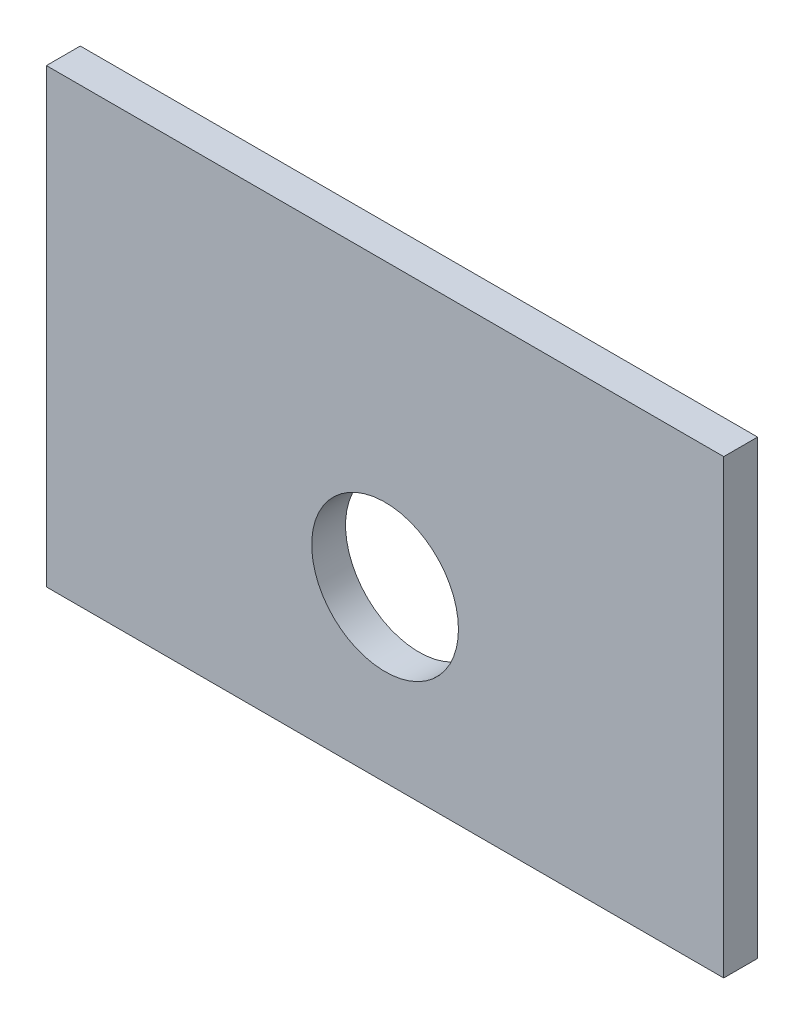
ISO-10303-21;
HEADER;
FILE_DESCRIPTION(('STEP AP214'),'2;1');
FILE_NAME('part.step','',(''),(''),'','','');
FILE_SCHEMA(('AUTOMOTIVE_DESIGN { 1 0 10303 214 1 1 1 1 }'));
ENDSEC;
DATA;
#1=APPLICATION_CONTEXT('core data for automotive mechanical design processes');
#2=APPLICATION_PROTOCOL_DEFINITION('international standard','automotive_design',2000,#1);
#3=PRODUCT_CONTEXT('',#1,'mechanical');
#4=PRODUCT('Part','Part','',(#3));
#5=PRODUCT_RELATED_PRODUCT_CATEGORY('part','',(#4));
#6=PRODUCT_DEFINITION_FORMATION('','',#4);
#7=PRODUCT_DEFINITION_CONTEXT('part definition',#1,'design');
#8=PRODUCT_DEFINITION('design','',#6,#7);
#9=PRODUCT_DEFINITION_SHAPE('','',#8);
#10=(LENGTH_UNIT() NAMED_UNIT(*) SI_UNIT(.MILLI.,.METRE.));
#11=(NAMED_UNIT(*) PLANE_ANGLE_UNIT() SI_UNIT($,.RADIAN.));
#12=(NAMED_UNIT(*) SI_UNIT($,.STERADIAN.) SOLID_ANGLE_UNIT());
#13=UNCERTAINTY_MEASURE_WITH_UNIT(LENGTH_MEASURE(1.E-05),#10,'distance_accuracy_value','');
#14=(GEOMETRIC_REPRESENTATION_CONTEXT(3) GLOBAL_UNCERTAINTY_ASSIGNED_CONTEXT((#13)) GLOBAL_UNIT_ASSIGNED_CONTEXT((#10,
#11,#12)) REPRESENTATION_CONTEXT('',''));
#15=CARTESIAN_POINT('',(0.,0.,0.));
#16=DIRECTION('',(0.,0.,1.));
#17=DIRECTION('',(1.,0.,0.));
#18=AXIS2_PLACEMENT_3D('',#15,#16,#17);
#19=CARTESIAN_POINT('',(0.,0.,-1.5));
#20=DIRECTION('',(-1.,0.,0.));
#21=DIRECTION('',(0.,-1.,0.));
#22=AXIS2_PLACEMENT_3D('',#19,#20,#21);
#23=PLANE('',#22);
#24=DIRECTION('',(0.,-1.,0.));
#25=VECTOR('',#24,1.);
#26=CARTESIAN_POINT('',(0.,0.,0.));
#27=LINE('',#26,#25);
#28=CARTESIAN_POINT('',(0.,20.,0.));
#29=VERTEX_POINT('',#28);
#30=CARTESIAN_POINT('',(0.,0.,0.));
#31=VERTEX_POINT('',#30);
#32=EDGE_CURVE('E101',#29,#31,#27,.T.);
#33=ORIENTED_EDGE('',*,*,#32,.F.);
#34=DIRECTION('',(0.,0.,1.));
#35=VECTOR('',#34,1.);
#36=CARTESIAN_POINT('',(0.,20.,-1.5));
#37=LINE('',#36,#35);
#38=CARTESIAN_POINT('',(0.,20.,-1.5));
#39=VERTEX_POINT('',#38);
#40=EDGE_CURVE('E11',#39,#29,#37,.T.);
#41=ORIENTED_EDGE('',*,*,#40,.F.);
#42=DIRECTION('',(0.,-1.,0.));
#43=VECTOR('',#42,1.);
#44=CARTESIAN_POINT('',(0.,0.,-1.5));
#45=LINE('',#44,#43);
#46=CARTESIAN_POINT('',(0.,0.,-1.5));
#47=VERTEX_POINT('',#46);
#48=EDGE_CURVE('E94',#39,#47,#45,.T.);
#49=ORIENTED_EDGE('',*,*,#48,.T.);
#50=DIRECTION('',(0.,0.,1.));
#51=VECTOR('',#50,1.);
#52=CARTESIAN_POINT('',(0.,0.,-1.5));
#53=LINE('',#52,#51);
#54=EDGE_CURVE('E39',#47,#31,#53,.T.);
#55=ORIENTED_EDGE('',*,*,#54,.T.);
#56=EDGE_LOOP('',(#33,#41,#49,#55));
#57=FACE_BOUND('',#56,.T.);
#58=ADVANCED_FACE('F36',(#57),#23,.T.);
#59=CARTESIAN_POINT('',(0.,20.,-1.5));
#60=DIRECTION('',(0.,1.,0.));
#61=DIRECTION('',(0.,0.,1.));
#62=AXIS2_PLACEMENT_3D('',#59,#60,#61);
#63=PLANE('',#62);
#64=DIRECTION('',(-1.,0.,0.));
#65=VECTOR('',#64,1.);
#66=CARTESIAN_POINT('',(0.,20.,0.));
#67=LINE('',#66,#65);
#68=CARTESIAN_POINT('',(30.,20.,0.));
#69=VERTEX_POINT('',#68);
#70=EDGE_CURVE('E96',#69,#29,#67,.T.);
#71=ORIENTED_EDGE('',*,*,#70,.F.);
#72=DIRECTION('',(0.,0.,1.));
#73=VECTOR('',#72,1.);
#74=CARTESIAN_POINT('',(30.,20.,-1.5));
#75=LINE('',#74,#73);
#76=CARTESIAN_POINT('',(30.,20.,-1.5));
#77=VERTEX_POINT('',#76);
#78=EDGE_CURVE('E45',#77,#69,#75,.T.);
#79=ORIENTED_EDGE('',*,*,#78,.F.);
#80=DIRECTION('',(-1.,0.,0.));
#81=VECTOR('',#80,1.);
#82=CARTESIAN_POINT('',(0.,20.,-1.5));
#83=LINE('',#82,#81);
#84=EDGE_CURVE('E91',#77,#39,#83,.T.);
#85=ORIENTED_EDGE('',*,*,#84,.T.);
#86=ORIENTED_EDGE('',*,*,#40,.T.);
#87=EDGE_LOOP('',(#71,#79,#85,#86));
#88=FACE_BOUND('',#87,.T.);
#89=ADVANCED_FACE('F112',(#88),#63,.T.);
#90=CARTESIAN_POINT('',(30.,0.,-1.5));
#91=DIRECTION('',(1.,0.,0.));
#92=DIRECTION('',(0.,1.,0.));
#93=AXIS2_PLACEMENT_3D('',#90,#91,#92);
#94=PLANE('',#93);
#95=DIRECTION('',(0.,1.,0.));
#96=VECTOR('',#95,1.);
#97=CARTESIAN_POINT('',(30.,0.,0.));
#98=LINE('',#97,#96);
#99=CARTESIAN_POINT('',(30.,0.,0.));
#100=VERTEX_POINT('',#99);
#101=EDGE_CURVE('E86',#100,#69,#98,.T.);
#102=ORIENTED_EDGE('',*,*,#101,.F.);
#103=DIRECTION('',(0.,0.,1.));
#104=VECTOR('',#103,1.);
#105=CARTESIAN_POINT('',(30.,0.,-1.5));
#106=LINE('',#105,#104);
#107=CARTESIAN_POINT('',(30.,0.,-1.5));
#108=VERTEX_POINT('',#107);
#109=EDGE_CURVE('E81',#108,#100,#106,.T.);
#110=ORIENTED_EDGE('',*,*,#109,.F.);
#111=DIRECTION('',(0.,1.,0.));
#112=VECTOR('',#111,1.);
#113=CARTESIAN_POINT('',(30.,0.,-1.5));
#114=LINE('',#113,#112);
#115=EDGE_CURVE('E84',#108,#77,#114,.T.);
#116=ORIENTED_EDGE('',*,*,#115,.T.);
#117=ORIENTED_EDGE('',*,*,#78,.T.);
#118=EDGE_LOOP('',(#102,#110,#116,#117));
#119=FACE_BOUND('',#118,.T.);
#120=ADVANCED_FACE('F83',(#119),#94,.T.);
#121=CARTESIAN_POINT('',(0.,0.,-1.5));
#122=DIRECTION('',(0.,-1.,0.));
#123=DIRECTION('',(0.,0.,-1.));
#124=AXIS2_PLACEMENT_3D('',#121,#122,#123);
#125=PLANE('',#124);
#126=DIRECTION('',(1.,0.,0.));
#127=VECTOR('',#126,1.);
#128=CARTESIAN_POINT('',(0.,0.,0.));
#129=LINE('',#128,#127);
#130=EDGE_CURVE('E104',#31,#100,#129,.T.);
#131=ORIENTED_EDGE('',*,*,#130,.F.);
#132=ORIENTED_EDGE('',*,*,#54,.F.);
#133=DIRECTION('',(1.,0.,0.));
#134=VECTOR('',#133,1.);
#135=CARTESIAN_POINT('',(0.,0.,-1.5));
#136=LINE('',#135,#134);
#137=EDGE_CURVE('E90',#47,#108,#136,.T.);
#138=ORIENTED_EDGE('',*,*,#137,.T.);
#139=ORIENTED_EDGE('',*,*,#109,.T.);
#140=EDGE_LOOP('',(#131,#132,#138,#139));
#141=FACE_BOUND('',#140,.T.);
#142=ADVANCED_FACE('F93',(#141),#125,.T.);
#143=CARTESIAN_POINT('',(0.,0.,-1.5));
#144=DIRECTION('',(0.,0.,-1.));
#145=DIRECTION('',(-1.,0.,0.));
#146=AXIS2_PLACEMENT_3D('',#143,#144,#145);
#147=PLANE('',#146);
#148=CARTESIAN_POINT('',(15.,7.5,-1.5));
#149=DIRECTION('',(0.,0.,1.));
#150=DIRECTION('',(1.,0.,0.));
#151=AXIS2_PLACEMENT_3D('',#148,#149,#150);
#152=CIRCLE('',#151,3.25);
#153=CARTESIAN_POINT('',(18.25,7.5,-1.5));
#154=VERTEX_POINT('',#153);
#155=EDGE_CURVE('E105',#154,#154,#152,.T.);
#156=ORIENTED_EDGE('',*,*,#155,.T.);
#157=EDGE_LOOP('',(#156));
#158=FACE_BOUND('',#157,.T.);
#159=ORIENTED_EDGE('',*,*,#48,.F.);
#160=ORIENTED_EDGE('',*,*,#84,.F.);
#161=ORIENTED_EDGE('',*,*,#115,.F.);
#162=ORIENTED_EDGE('',*,*,#137,.F.);
#163=EDGE_LOOP('',(#159,#160,#161,#162));
#164=FACE_BOUND('',#163,.T.);
#165=ADVANCED_FACE('F89',(#158,#164),#147,.T.);
#166=CARTESIAN_POINT('',(0.,0.,0.));
#167=DIRECTION('',(0.,0.,-1.));
#168=DIRECTION('',(-1.,0.,0.));
#169=AXIS2_PLACEMENT_3D('',#166,#167,#168);
#170=PLANE('',#169);
#171=CARTESIAN_POINT('',(15.,7.5,0.));
#172=DIRECTION('',(0.,0.,1.));
#173=DIRECTION('',(1.,0.,0.));
#174=AXIS2_PLACEMENT_3D('',#171,#172,#173);
#175=CIRCLE('',#174,3.25);
#176=CARTESIAN_POINT('',(18.25,7.5,0.));
#177=VERTEX_POINT('',#176);
#178=EDGE_CURVE('E142',#177,#177,#175,.T.);
#179=ORIENTED_EDGE('',*,*,#178,.F.);
#180=EDGE_LOOP('',(#179));
#181=FACE_BOUND('',#180,.T.);
#182=ORIENTED_EDGE('',*,*,#32,.T.);
#183=ORIENTED_EDGE('',*,*,#130,.T.);
#184=ORIENTED_EDGE('',*,*,#101,.T.);
#185=ORIENTED_EDGE('',*,*,#70,.T.);
#186=EDGE_LOOP('',(#182,#183,#184,#185));
#187=FACE_BOUND('',#186,.T.);
#188=ADVANCED_FACE('F111',(#181,#187),#170,.F.);
#189=CARTESIAN_POINT('',(15.,7.5,-1.5));
#190=DIRECTION('',(0.,0.,1.));
#191=DIRECTION('',(1.,0.,0.));
#192=AXIS2_PLACEMENT_3D('',#189,#190,#191);
#193=CYLINDRICAL_SURFACE('',#192,3.25);
#194=ORIENTED_EDGE('',*,*,#155,.F.);
#195=EDGE_LOOP('',(#194));
#196=FACE_BOUND('',#195,.T.);
#197=ORIENTED_EDGE('',*,*,#178,.T.);
#198=EDGE_LOOP('',(#197));
#199=FACE_BOUND('',#198,.T.);
#200=ADVANCED_FACE('F130',(#196,#199),#193,.F.);
#201=CLOSED_SHELL('',(#58,#89,#120,#142,#165,#188,#200));
#202=MANIFOLD_SOLID_BREP('B2',#201);
#203=ADVANCED_BREP_SHAPE_REPRESENTATION('',(#18,#202),#14);
#204=SHAPE_DEFINITION_REPRESENTATION(#9,#203);
ENDSEC;
END-ISO-10303-21;
